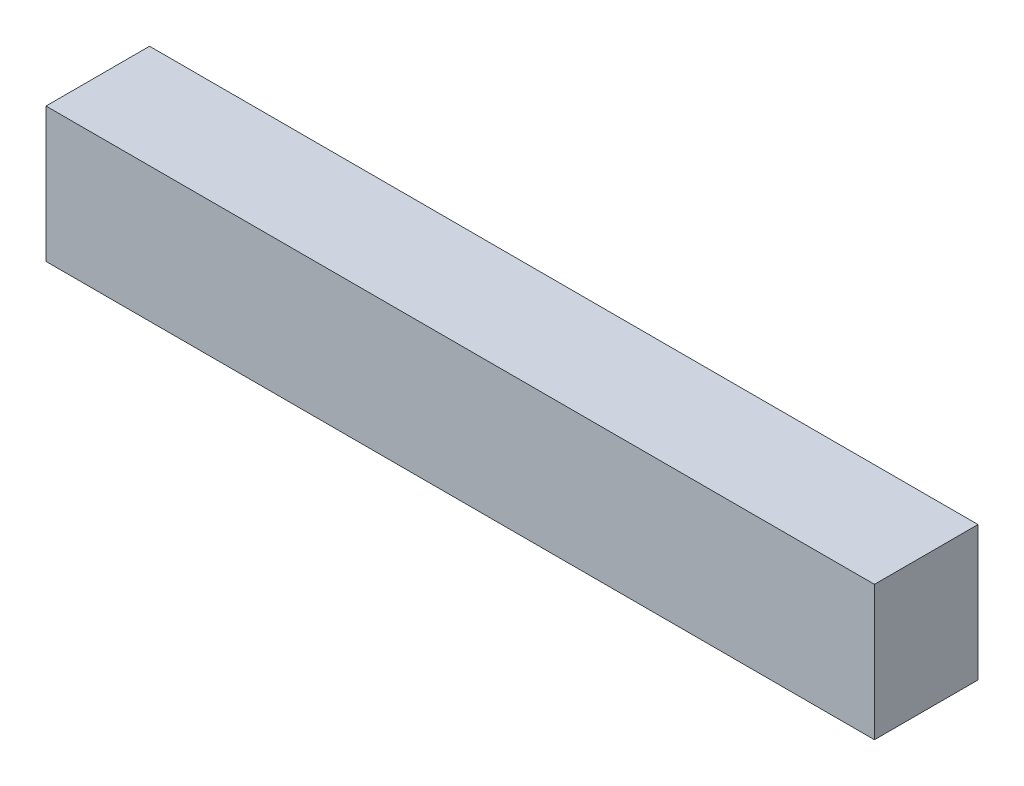
ISO-10303-21;
HEADER;
FILE_DESCRIPTION(('STEP AP214'),'2;1');
FILE_NAME('part.step','',(''),(''),'','','');
FILE_SCHEMA(('AUTOMOTIVE_DESIGN { 1 0 10303 214 1 1 1 1 }'));
ENDSEC;
DATA;
#1=APPLICATION_CONTEXT('core data for automotive mechanical design processes');
#2=APPLICATION_PROTOCOL_DEFINITION('international standard','automotive_design',2000,#1);
#3=PRODUCT_CONTEXT('',#1,'mechanical');
#4=PRODUCT('Part','Part','',(#3));
#5=PRODUCT_RELATED_PRODUCT_CATEGORY('part','',(#4));
#6=PRODUCT_DEFINITION_FORMATION('','',#4);
#7=PRODUCT_DEFINITION_CONTEXT('part definition',#1,'design');
#8=PRODUCT_DEFINITION('design','',#6,#7);
#9=PRODUCT_DEFINITION_SHAPE('','',#8);
#10=(LENGTH_UNIT() NAMED_UNIT(*) SI_UNIT(.MILLI.,.METRE.));
#11=(NAMED_UNIT(*) PLANE_ANGLE_UNIT() SI_UNIT($,.RADIAN.));
#12=(NAMED_UNIT(*) SI_UNIT($,.STERADIAN.) SOLID_ANGLE_UNIT());
#13=UNCERTAINTY_MEASURE_WITH_UNIT(LENGTH_MEASURE(1.E-05),#10,'distance_accuracy_value','');
#14=(GEOMETRIC_REPRESENTATION_CONTEXT(3) GLOBAL_UNCERTAINTY_ASSIGNED_CONTEXT((#13)) GLOBAL_UNIT_ASSIGNED_CONTEXT((#10,
#11,#12)) REPRESENTATION_CONTEXT('',''));
#15=CARTESIAN_POINT('',(0.,0.,0.));
#16=DIRECTION('',(0.,0.,1.));
#17=DIRECTION('',(1.,0.,0.));
#18=AXIS2_PLACEMENT_3D('',#15,#16,#17);
#19=CARTESIAN_POINT('',(20.,3.25,5.));
#20=DIRECTION('',(-1.,0.,0.));
#21=DIRECTION('',(0.,0.,1.));
#22=AXIS2_PLACEMENT_3D('',#19,#20,#21);
#23=PLANE('',#22);
#24=DIRECTION('',(0.,1.,0.));
#25=VECTOR('',#24,1.);
#26=CARTESIAN_POINT('',(20.,3.25,0.));
#27=LINE('',#26,#25);
#28=CARTESIAN_POINT('',(20.,-3.25,0.));
#29=VERTEX_POINT('',#28);
#30=CARTESIAN_POINT('',(20.,3.25,0.));
#31=VERTEX_POINT('',#30);
#32=EDGE_CURVE('E113',#29,#31,#27,.T.);
#33=ORIENTED_EDGE('',*,*,#32,.T.);
#34=DIRECTION('',(0.,0.,-1.));
#35=VECTOR('',#34,1.);
#36=CARTESIAN_POINT('',(20.,3.25,5.));
#37=LINE('',#36,#35);
#38=CARTESIAN_POINT('',(20.,3.25,5.));
#39=VERTEX_POINT('',#38);
#40=EDGE_CURVE('E11',#39,#31,#37,.T.);
#41=ORIENTED_EDGE('',*,*,#40,.F.);
#42=DIRECTION('',(0.,1.,0.));
#43=VECTOR('',#42,1.);
#44=CARTESIAN_POINT('',(20.,3.25,5.));
#45=LINE('',#44,#43);
#46=CARTESIAN_POINT('',(20.,-3.25,5.));
#47=VERTEX_POINT('',#46);
#48=EDGE_CURVE('E97',#47,#39,#45,.T.);
#49=ORIENTED_EDGE('',*,*,#48,.F.);
#50=DIRECTION('',(0.,0.,-1.));
#51=VECTOR('',#50,1.);
#52=CARTESIAN_POINT('',(20.,-3.25,5.));
#53=LINE('',#52,#51);
#54=EDGE_CURVE('E109',#47,#29,#53,.T.);
#55=ORIENTED_EDGE('',*,*,#54,.T.);
#56=EDGE_LOOP('',(#33,#41,#49,#55));
#57=FACE_BOUND('',#56,.T.);
#58=ADVANCED_FACE('F45',(#57),#23,.F.);
#59=CARTESIAN_POINT('',(-20.,3.25,5.));
#60=DIRECTION('',(0.,-1.,0.));
#61=DIRECTION('',(0.,0.,-1.));
#62=AXIS2_PLACEMENT_3D('',#59,#60,#61);
#63=PLANE('',#62);
#64=DIRECTION('',(-1.,0.,0.));
#65=VECTOR('',#64,1.);
#66=CARTESIAN_POINT('',(-20.,3.25,0.));
#67=LINE('',#66,#65);
#68=CARTESIAN_POINT('',(-20.,3.25,0.));
#69=VERTEX_POINT('',#68);
#70=EDGE_CURVE('E102',#31,#69,#67,.T.);
#71=ORIENTED_EDGE('',*,*,#70,.T.);
#72=DIRECTION('',(0.,0.,-1.));
#73=VECTOR('',#72,1.);
#74=CARTESIAN_POINT('',(-20.,3.25,5.));
#75=LINE('',#74,#73);
#76=CARTESIAN_POINT('',(-20.,3.25,5.));
#77=VERTEX_POINT('',#76);
#78=EDGE_CURVE('E54',#77,#69,#75,.T.);
#79=ORIENTED_EDGE('',*,*,#78,.F.);
#80=DIRECTION('',(-1.,0.,0.));
#81=VECTOR('',#80,1.);
#82=CARTESIAN_POINT('',(-20.,3.25,5.));
#83=LINE('',#82,#81);
#84=EDGE_CURVE('E92',#39,#77,#83,.T.);
#85=ORIENTED_EDGE('',*,*,#84,.F.);
#86=ORIENTED_EDGE('',*,*,#40,.T.);
#87=EDGE_LOOP('',(#71,#79,#85,#86));
#88=FACE_BOUND('',#87,.T.);
#89=ADVANCED_FACE('F101',(#88),#63,.F.);
#90=CARTESIAN_POINT('',(-20.,3.25,5.));
#91=DIRECTION('',(1.,0.,0.));
#92=DIRECTION('',(0.,0.,-1.));
#93=AXIS2_PLACEMENT_3D('',#90,#91,#92);
#94=PLANE('',#93);
#95=DIRECTION('',(0.,-1.,0.));
#96=VECTOR('',#95,1.);
#97=CARTESIAN_POINT('',(-20.,3.25,0.));
#98=LINE('',#97,#96);
#99=CARTESIAN_POINT('',(-20.,-3.25,0.));
#100=VERTEX_POINT('',#99);
#101=EDGE_CURVE('E79',#69,#100,#98,.T.);
#102=ORIENTED_EDGE('',*,*,#101,.T.);
#103=DIRECTION('',(0.,0.,-1.));
#104=VECTOR('',#103,1.);
#105=CARTESIAN_POINT('',(-20.,-3.25,5.));
#106=LINE('',#105,#104);
#107=CARTESIAN_POINT('',(-20.,-3.25,5.));
#108=VERTEX_POINT('',#107);
#109=EDGE_CURVE('E104',#108,#100,#106,.T.);
#110=ORIENTED_EDGE('',*,*,#109,.F.);
#111=DIRECTION('',(0.,-1.,0.));
#112=VECTOR('',#111,1.);
#113=CARTESIAN_POINT('',(-20.,3.25,5.));
#114=LINE('',#113,#112);
#115=EDGE_CURVE('E95',#77,#108,#114,.T.);
#116=ORIENTED_EDGE('',*,*,#115,.F.);
#117=ORIENTED_EDGE('',*,*,#78,.T.);
#118=EDGE_LOOP('',(#102,#110,#116,#117));
#119=FACE_BOUND('',#118,.T.);
#120=ADVANCED_FACE('F105',(#119),#94,.F.);
#121=CARTESIAN_POINT('',(-20.,-3.25,5.));
#122=DIRECTION('',(0.,1.,0.));
#123=DIRECTION('',(0.,0.,1.));
#124=AXIS2_PLACEMENT_3D('',#121,#122,#123);
#125=PLANE('',#124);
#126=DIRECTION('',(1.,0.,0.));
#127=VECTOR('',#126,1.);
#128=CARTESIAN_POINT('',(-20.,-3.25,0.));
#129=LINE('',#128,#127);
#130=EDGE_CURVE('E85',#100,#29,#129,.T.);
#131=ORIENTED_EDGE('',*,*,#130,.T.);
#132=ORIENTED_EDGE('',*,*,#54,.F.);
#133=DIRECTION('',(1.,0.,0.));
#134=VECTOR('',#133,1.);
#135=CARTESIAN_POINT('',(-20.,-3.25,5.));
#136=LINE('',#135,#134);
#137=EDGE_CURVE('E62',#108,#47,#136,.T.);
#138=ORIENTED_EDGE('',*,*,#137,.F.);
#139=ORIENTED_EDGE('',*,*,#109,.T.);
#140=EDGE_LOOP('',(#131,#132,#138,#139));
#141=FACE_BOUND('',#140,.T.);
#142=ADVANCED_FACE('F126',(#141),#125,.F.);
#143=CARTESIAN_POINT('',(0.,0.,5.));
#144=DIRECTION('',(0.,0.,1.));
#145=DIRECTION('',(1.,0.,0.));
#146=AXIS2_PLACEMENT_3D('',#143,#144,#145);
#147=PLANE('',#146);
#148=ORIENTED_EDGE('',*,*,#48,.T.);
#149=ORIENTED_EDGE('',*,*,#84,.T.);
#150=ORIENTED_EDGE('',*,*,#115,.T.);
#151=ORIENTED_EDGE('',*,*,#137,.T.);
#152=EDGE_LOOP('',(#148,#149,#150,#151));
#153=FACE_BOUND('',#152,.T.);
#154=ADVANCED_FACE('F93',(#153),#147,.T.);
#155=CARTESIAN_POINT('',(0.,0.,0.));
#156=DIRECTION('',(0.,0.,1.));
#157=DIRECTION('',(1.,0.,0.));
#158=AXIS2_PLACEMENT_3D('',#155,#156,#157);
#159=PLANE('',#158);
#160=ORIENTED_EDGE('',*,*,#32,.F.);
#161=ORIENTED_EDGE('',*,*,#130,.F.);
#162=ORIENTED_EDGE('',*,*,#101,.F.);
#163=ORIENTED_EDGE('',*,*,#70,.F.);
#164=EDGE_LOOP('',(#160,#161,#162,#163));
#165=FACE_BOUND('',#164,.T.);
#166=ADVANCED_FACE('F129',(#165),#159,.F.);
#167=CLOSED_SHELL('',(#58,#89,#120,#142,#154,#166));
#168=MANIFOLD_SOLID_BREP('B2',#167);
#169=ADVANCED_BREP_SHAPE_REPRESENTATION('',(#18,#168),#14);
#170=SHAPE_DEFINITION_REPRESENTATION(#9,#169);
ENDSEC;
END-ISO-10303-21;
